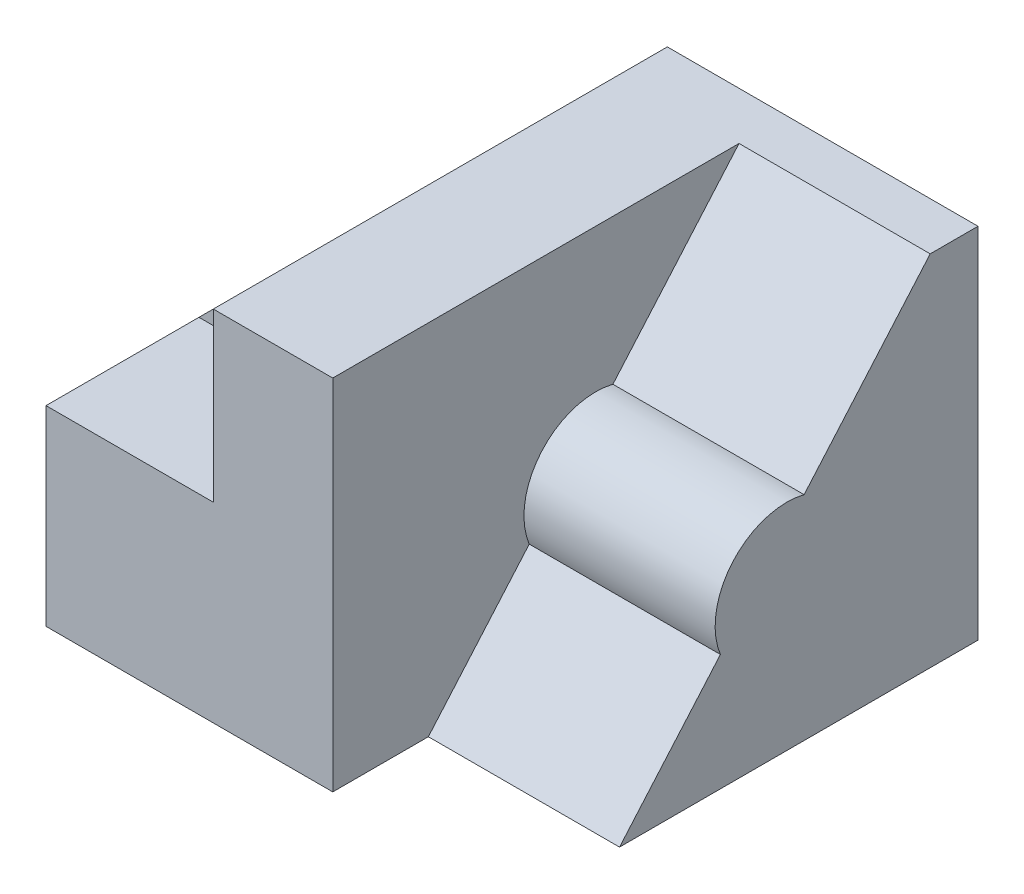
ISO-10303-21;
HEADER;
FILE_DESCRIPTION(('STEP AP214'),'2;1');
FILE_NAME('part.step','',(''),(''),'','','');
FILE_SCHEMA(('AUTOMOTIVE_DESIGN { 1 0 10303 214 1 1 1 1 }'));
ENDSEC;
DATA;
#1=APPLICATION_CONTEXT('core data for automotive mechanical design processes');
#2=APPLICATION_PROTOCOL_DEFINITION('international standard','automotive_design',2000,#1);
#3=PRODUCT_CONTEXT('',#1,'mechanical');
#4=PRODUCT('Part','Part','',(#3));
#5=PRODUCT_RELATED_PRODUCT_CATEGORY('part','',(#4));
#6=PRODUCT_DEFINITION_FORMATION('','',#4);
#7=PRODUCT_DEFINITION_CONTEXT('part definition',#1,'design');
#8=PRODUCT_DEFINITION('design','',#6,#7);
#9=PRODUCT_DEFINITION_SHAPE('','',#8);
#10=(LENGTH_UNIT() NAMED_UNIT(*) SI_UNIT(.MILLI.,.METRE.));
#11=(NAMED_UNIT(*) PLANE_ANGLE_UNIT() SI_UNIT($,.RADIAN.));
#12=(NAMED_UNIT(*) SI_UNIT($,.STERADIAN.) SOLID_ANGLE_UNIT());
#13=UNCERTAINTY_MEASURE_WITH_UNIT(LENGTH_MEASURE(1.E-05),#10,'distance_accuracy_value','');
#14=(GEOMETRIC_REPRESENTATION_CONTEXT(3) GLOBAL_UNCERTAINTY_ASSIGNED_CONTEXT((#13)) GLOBAL_UNIT_ASSIGNED_CONTEXT((#10,
#11,#12)) REPRESENTATION_CONTEXT('',''));
#15=CARTESIAN_POINT('',(0.,0.,0.));
#16=DIRECTION('',(0.,0.,1.));
#17=DIRECTION('',(1.,0.,0.));
#18=AXIS2_PLACEMENT_3D('',#15,#16,#17);
#19=CARTESIAN_POINT('',(35.,37.5,-47.5));
#20=DIRECTION('',(1.,0.,0.));
#21=DIRECTION('',(0.,1.,0.));
#22=AXIS2_PLACEMENT_3D('',#19,#20,#21);
#23=PLANE('',#22);
#24=DIRECTION('',(0.,1.,0.));
#25=VECTOR('',#24,1.);
#26=CARTESIAN_POINT('',(35.,2.49999999999999,15.5));
#27=LINE('',#26,#25);
#28=CARTESIAN_POINT('',(35.,2.49999999999999,15.5));
#29=VERTEX_POINT('',#28);
#30=CARTESIAN_POINT('',(35.,37.5,15.5));
#31=VERTEX_POINT('',#30);
#32=EDGE_CURVE('E148',#29,#31,#27,.T.);
#33=ORIENTED_EDGE('',*,*,#32,.F.);
#34=DIRECTION('',(0.,0.,1.));
#35=VECTOR('',#34,1.);
#36=CARTESIAN_POINT('',(35.,2.49999999999999,-47.5));
#37=LINE('',#36,#35);
#38=CARTESIAN_POINT('',(35.,2.49999999999999,47.5));
#39=VERTEX_POINT('',#38);
#40=EDGE_CURVE('E196',#29,#39,#37,.T.);
#41=ORIENTED_EDGE('',*,*,#40,.T.);
#42=DIRECTION('',(0.,1.,0.));
#43=VECTOR('',#42,1.);
#44=CARTESIAN_POINT('',(35.,37.5,47.5));
#45=LINE('',#44,#43);
#46=CARTESIAN_POINT('',(35.,37.5,47.5));
#47=VERTEX_POINT('',#46);
#48=EDGE_CURVE('E161',#39,#47,#45,.T.);
#49=ORIENTED_EDGE('',*,*,#48,.T.);
#50=DIRECTION('',(0.,0.,1.));
#51=VECTOR('',#50,1.);
#52=CARTESIAN_POINT('',(35.,37.5,-47.5));
#53=LINE('',#52,#51);
#54=EDGE_CURVE('E159',#31,#47,#53,.T.);
#55=ORIENTED_EDGE('',*,*,#54,.F.);
#56=EDGE_LOOP('',(#33,#41,#49,#55));
#57=FACE_BOUND('',#56,.T.);
#58=ADVANCED_FACE('F39',(#57),#23,.F.);
#59=CARTESIAN_POINT('',(0.,2.49999999999999,-47.5));
#60=DIRECTION('',(0.,-1.,0.));
#61=DIRECTION('',(0.,0.,-1.));
#62=AXIS2_PLACEMENT_3D('',#59,#60,#61);
#63=PLANE('',#62);
#64=DIRECTION('',(1.,0.,0.));
#65=VECTOR('',#64,1.);
#66=CARTESIAN_POINT('',(0.,2.49999999999999,15.5));
#67=LINE('',#66,#65);
#68=CARTESIAN_POINT('',(0.,2.49999999999999,15.5));
#69=VERTEX_POINT('',#68);
#70=EDGE_CURVE('E147',#69,#29,#67,.T.);
#71=ORIENTED_EDGE('',*,*,#70,.F.);
#72=DIRECTION('',(0.,0.,1.));
#73=VECTOR('',#72,1.);
#74=CARTESIAN_POINT('',(0.,2.49999999999999,-47.5));
#75=LINE('',#74,#73);
#76=CARTESIAN_POINT('',(0.,2.49999999999999,47.5));
#77=VERTEX_POINT('',#76);
#78=EDGE_CURVE('E187',#69,#77,#75,.T.);
#79=ORIENTED_EDGE('',*,*,#78,.T.);
#80=DIRECTION('',(1.,0.,0.));
#81=VECTOR('',#80,1.);
#82=CARTESIAN_POINT('',(0.,2.49999999999999,47.5));
#83=LINE('',#82,#81);
#84=EDGE_CURVE('E173',#77,#39,#83,.T.);
#85=ORIENTED_EDGE('',*,*,#84,.T.);
#86=ORIENTED_EDGE('',*,*,#40,.F.);
#87=EDGE_LOOP('',(#71,#79,#85,#86));
#88=FACE_BOUND('',#87,.T.);
#89=ADVANCED_FACE('F312',(#88),#63,.F.);
#90=CARTESIAN_POINT('',(100.,37.5,47.5));
#91=DIRECTION('',(0.,0.,-1.));
#92=DIRECTION('',(0.,1.,0.));
#93=AXIS2_PLACEMENT_3D('',#90,#91,#92);
#94=PLANE('',#93);
#95=DIRECTION('',(-1.,0.,0.));
#96=VECTOR('',#95,1.);
#97=CARTESIAN_POINT('',(100.,37.5,47.5));
#98=LINE('',#97,#96);
#99=CARTESIAN_POINT('',(60.,37.5,47.5));
#100=VERTEX_POINT('',#99);
#101=EDGE_CURVE('E255',#100,#47,#98,.T.);
#102=ORIENTED_EDGE('',*,*,#101,.T.);
#103=ORIENTED_EDGE('',*,*,#48,.F.);
#104=ORIENTED_EDGE('',*,*,#84,.F.);
#105=DIRECTION('',(0.,-1.,0.));
#106=VECTOR('',#105,1.);
#107=CARTESIAN_POINT('',(0.,37.5,47.5));
#108=LINE('',#107,#106);
#109=CARTESIAN_POINT('',(0.,-37.5,47.5));
#110=VERTEX_POINT('',#109);
#111=EDGE_CURVE('E235',#77,#110,#108,.T.);
#112=ORIENTED_EDGE('',*,*,#111,.T.);
#113=DIRECTION('',(-1.,0.,0.));
#114=VECTOR('',#113,1.);
#115=CARTESIAN_POINT('',(100.,-37.5,47.5));
#116=LINE('',#115,#114);
#117=CARTESIAN_POINT('',(60.,-37.5,47.5));
#118=VERTEX_POINT('',#117);
#119=EDGE_CURVE('E11',#118,#110,#116,.T.);
#120=ORIENTED_EDGE('',*,*,#119,.F.);
#121=DIRECTION('',(0.,-1.,0.));
#122=VECTOR('',#121,1.);
#123=CARTESIAN_POINT('',(60.,37.5,47.5));
#124=LINE('',#123,#122);
#125=EDGE_CURVE('E200',#100,#118,#124,.T.);
#126=ORIENTED_EDGE('',*,*,#125,.F.);
#127=EDGE_LOOP('',(#102,#103,#104,#112,#120,#126));
#128=FACE_BOUND('',#127,.T.);
#129=ADVANCED_FACE('F41',(#128),#94,.F.);
#130=CARTESIAN_POINT('',(100.,-37.5,-47.5));
#131=DIRECTION('',(0.,1.,0.));
#132=DIRECTION('',(0.,0.,1.));
#133=AXIS2_PLACEMENT_3D('',#130,#131,#132);
#134=PLANE('',#133);
#135=DIRECTION('',(1.,0.,0.));
#136=VECTOR('',#135,1.);
#137=CARTESIAN_POINT('',(60.,-37.5,27.5));
#138=LINE('',#137,#136);
#139=CARTESIAN_POINT('',(60.,-37.5,27.5));
#140=VERTEX_POINT('',#139);
#141=CARTESIAN_POINT('',(100.,-37.5,27.5));
#142=VERTEX_POINT('',#141);
#143=EDGE_CURVE('E220',#140,#142,#138,.T.);
#144=ORIENTED_EDGE('',*,*,#143,.F.);
#145=DIRECTION('',(0.,0.,-1.));
#146=VECTOR('',#145,1.);
#147=CARTESIAN_POINT('',(60.,-37.5,47.5));
#148=LINE('',#147,#146);
#149=EDGE_CURVE('E203',#118,#140,#148,.T.);
#150=ORIENTED_EDGE('',*,*,#149,.F.);
#151=ORIENTED_EDGE('',*,*,#119,.T.);
#152=DIRECTION('',(0.,0.,-1.));
#153=VECTOR('',#152,1.);
#154=CARTESIAN_POINT('',(0.,-37.5,-47.5));
#155=LINE('',#154,#153);
#156=CARTESIAN_POINT('',(0.,-37.5,-47.5));
#157=VERTEX_POINT('',#156);
#158=EDGE_CURVE('E258',#110,#157,#155,.T.);
#159=ORIENTED_EDGE('',*,*,#158,.T.);
#160=DIRECTION('',(-1.,0.,0.));
#161=VECTOR('',#160,1.);
#162=CARTESIAN_POINT('',(100.,-37.5,-47.5));
#163=LINE('',#162,#161);
#164=CARTESIAN_POINT('',(100.,-37.5,-47.5));
#165=VERTEX_POINT('',#164);
#166=EDGE_CURVE('E48',#165,#157,#163,.T.);
#167=ORIENTED_EDGE('',*,*,#166,.F.);
#168=DIRECTION('',(0.,0.,-1.));
#169=VECTOR('',#168,1.);
#170=CARTESIAN_POINT('',(100.,-37.5,-47.5));
#171=LINE('',#170,#169);
#172=EDGE_CURVE('E244',#142,#165,#171,.T.);
#173=ORIENTED_EDGE('',*,*,#172,.F.);
#174=EDGE_LOOP('',(#144,#150,#151,#159,#167,#173));
#175=FACE_BOUND('',#174,.T.);
#176=ADVANCED_FACE('F295',(#175),#134,.F.);
#177=CARTESIAN_POINT('',(100.,37.5,-47.5));
#178=DIRECTION('',(0.,-1.,0.));
#179=DIRECTION('',(0.,0.,-1.));
#180=AXIS2_PLACEMENT_3D('',#177,#178,#179);
#181=PLANE('',#180);
#182=DIRECTION('',(-1.,0.,0.));
#183=VECTOR('',#182,1.);
#184=CARTESIAN_POINT('',(100.,37.5,-47.5));
#185=LINE('',#184,#183);
#186=CARTESIAN_POINT('',(100.,37.5,-47.5));
#187=VERTEX_POINT('',#186);
#188=CARTESIAN_POINT('',(35.,37.5,-47.5));
#189=VERTEX_POINT('',#188);
#190=EDGE_CURVE('E266',#187,#189,#185,.T.);
#191=ORIENTED_EDGE('',*,*,#190,.T.);
#192=CARTESIAN_POINT('',(35.,37.5,9.50000000000001));
#193=VERTEX_POINT('',#192);
#194=EDGE_CURVE('E166',#189,#193,#53,.T.);
#195=ORIENTED_EDGE('',*,*,#194,.T.);
#196=DIRECTION('',(0.,0.,-1.));
#197=VECTOR('',#196,1.);
#198=CARTESIAN_POINT('',(35.,37.5,15.5));
#199=LINE('',#198,#197);
#200=EDGE_CURVE('E141',#31,#193,#199,.T.);
#201=ORIENTED_EDGE('',*,*,#200,.F.);
#202=ORIENTED_EDGE('',*,*,#54,.T.);
#203=ORIENTED_EDGE('',*,*,#101,.F.);
#204=DIRECTION('',(0.,0.,1.));
#205=VECTOR('',#204,1.);
#206=CARTESIAN_POINT('',(60.,37.5,-37.5));
#207=LINE('',#206,#205);
#208=CARTESIAN_POINT('',(60.,37.5,-37.5));
#209=VERTEX_POINT('',#208);
#210=EDGE_CURVE('E217',#209,#100,#207,.T.);
#211=ORIENTED_EDGE('',*,*,#210,.F.);
#212=DIRECTION('',(1.,0.,0.));
#213=VECTOR('',#212,1.);
#214=CARTESIAN_POINT('',(60.,37.5,-37.5));
#215=LINE('',#214,#213);
#216=CARTESIAN_POINT('',(100.,37.5,-37.5));
#217=VERTEX_POINT('',#216);
#218=EDGE_CURVE('E231',#209,#217,#215,.T.);
#219=ORIENTED_EDGE('',*,*,#218,.T.);
#220=DIRECTION('',(0.,0.,1.));
#221=VECTOR('',#220,1.);
#222=CARTESIAN_POINT('',(100.,37.5,-47.5));
#223=LINE('',#222,#221);
#224=EDGE_CURVE('E251',#187,#217,#223,.T.);
#225=ORIENTED_EDGE('',*,*,#224,.F.);
#226=EDGE_LOOP('',(#191,#195,#201,#202,#203,#211,#219,#225));
#227=FACE_BOUND('',#226,.T.);
#228=ADVANCED_FACE('F171',(#227),#181,.F.);
#229=CARTESIAN_POINT('',(100.,0.,0.));
#230=DIRECTION('',(-1.,0.,0.));
#231=DIRECTION('',(0.,0.,1.));
#232=AXIS2_PLACEMENT_3D('',#229,#230,#231);
#233=PLANE('',#232);
#234=DIRECTION('',(0.,-0.755689082789818,0.654930538417842));
#235=VECTOR('',#234,1.);
#236=CARTESIAN_POINT('',(100.,37.5,-37.5));
#237=LINE('',#236,#235);
#238=CARTESIAN_POINT('',(100.,7.05750343379361,-11.1165029759545));
#239=VERTEX_POINT('',#238);
#240=EDGE_CURVE('E204',#217,#239,#237,.T.);
#241=ORIENTED_EDGE('',*,*,#240,.T.);
#242=CARTESIAN_POINT('',(100.,-7.49999999999999,-7.5));
#243=DIRECTION('',(1.,0.,0.));
#244=DIRECTION('',(0.,0.,-1.));
#245=AXIS2_PLACEMENT_3D('',#242,#243,#244);
#246=CIRCLE('',#245,15.);
#247=CARTESIAN_POINT('',(100.,-13.1488739921692,6.39569079321334));
#248=VERTEX_POINT('',#247);
#249=EDGE_CURVE('E224',#239,#248,#246,.T.);
#250=ORIENTED_EDGE('',*,*,#249,.T.);
#251=DIRECTION('',(0.,-0.755689082789818,0.654930538417842));
#252=VECTOR('',#251,1.);
#253=CARTESIAN_POINT('',(100.,-13.1488739921692,6.39569079321334));
#254=LINE('',#253,#252);
#255=EDGE_CURVE('E192',#248,#142,#254,.T.);
#256=ORIENTED_EDGE('',*,*,#255,.T.);
#257=ORIENTED_EDGE('',*,*,#172,.T.);
#258=DIRECTION('',(0.,1.,0.));
#259=VECTOR('',#258,1.);
#260=CARTESIAN_POINT('',(100.,37.5,-47.5));
#261=LINE('',#260,#259);
#262=EDGE_CURVE('E247',#165,#187,#261,.T.);
#263=ORIENTED_EDGE('',*,*,#262,.T.);
#264=ORIENTED_EDGE('',*,*,#224,.T.);
#265=EDGE_LOOP('',(#241,#250,#256,#257,#263,#264));
#266=FACE_BOUND('',#265,.T.);
#267=ADVANCED_FACE('F292',(#266),#233,.F.);
#268=CARTESIAN_POINT('',(100.,37.5,-47.5));
#269=DIRECTION('',(0.,0.,1.));
#270=DIRECTION('',(0.,-1.,0.));
#271=AXIS2_PLACEMENT_3D('',#268,#269,#270);
#272=PLANE('',#271);
#273=DIRECTION('',(1.,0.,0.));
#274=VECTOR('',#273,1.);
#275=CARTESIAN_POINT('',(0.,2.49999999999999,-47.5));
#276=LINE('',#275,#274);
#277=CARTESIAN_POINT('',(0.,2.49999999999999,-47.5));
#278=VERTEX_POINT('',#277);
#279=CARTESIAN_POINT('',(35.,2.49999999999999,-47.5));
#280=VERTEX_POINT('',#279);
#281=EDGE_CURVE('E63',#278,#280,#276,.T.);
#282=ORIENTED_EDGE('',*,*,#281,.T.);
#283=DIRECTION('',(0.,1.,0.));
#284=VECTOR('',#283,1.);
#285=CARTESIAN_POINT('',(35.,37.5,-47.5));
#286=LINE('',#285,#284);
#287=EDGE_CURVE('E184',#280,#189,#286,.T.);
#288=ORIENTED_EDGE('',*,*,#287,.T.);
#289=ORIENTED_EDGE('',*,*,#190,.F.);
#290=ORIENTED_EDGE('',*,*,#262,.F.);
#291=ORIENTED_EDGE('',*,*,#166,.T.);
#292=DIRECTION('',(0.,1.,0.));
#293=VECTOR('',#292,1.);
#294=CARTESIAN_POINT('',(0.,37.5,-47.5));
#295=LINE('',#294,#293);
#296=EDGE_CURVE('E248',#157,#278,#295,.T.);
#297=ORIENTED_EDGE('',*,*,#296,.T.);
#298=EDGE_LOOP('',(#282,#288,#289,#290,#291,#297));
#299=FACE_BOUND('',#298,.T.);
#300=ADVANCED_FACE('F274',(#299),#272,.F.);
#301=CARTESIAN_POINT('',(0.,0.,0.));
#302=DIRECTION('',(-1.,0.,0.));
#303=DIRECTION('',(0.,0.,1.));
#304=AXIS2_PLACEMENT_3D('',#301,#302,#303);
#305=PLANE('',#304);
#306=CARTESIAN_POINT('',(0.,2.49999999999999,9.50000000000001));
#307=VERTEX_POINT('',#306);
#308=EDGE_CURVE('E197',#278,#307,#75,.T.);
#309=ORIENTED_EDGE('',*,*,#308,.F.);
#310=ORIENTED_EDGE('',*,*,#296,.F.);
#311=ORIENTED_EDGE('',*,*,#158,.F.);
#312=ORIENTED_EDGE('',*,*,#111,.F.);
#313=ORIENTED_EDGE('',*,*,#78,.F.);
#314=DIRECTION('',(0.,0.,-1.));
#315=VECTOR('',#314,1.);
#316=CARTESIAN_POINT('',(0.,2.49999999999999,15.5));
#317=LINE('',#316,#315);
#318=EDGE_CURVE('E143',#69,#307,#317,.T.);
#319=ORIENTED_EDGE('',*,*,#318,.T.);
#320=EDGE_LOOP('',(#309,#310,#311,#312,#313,#319));
#321=FACE_BOUND('',#320,.T.);
#322=ADVANCED_FACE('F280',(#321),#305,.T.);
#323=CARTESIAN_POINT('',(60.,37.5,-37.5));
#324=DIRECTION('',(0.,0.654930538417842,0.755689082789818));
#325=DIRECTION('',(0.,-0.755689082789818,0.654930538417842));
#326=AXIS2_PLACEMENT_3D('',#323,#324,#325);
#327=PLANE('',#326);
#328=ORIENTED_EDGE('',*,*,#240,.F.);
#329=ORIENTED_EDGE('',*,*,#218,.F.);
#330=DIRECTION('',(0.,-0.755689082789818,0.654930538417842));
#331=VECTOR('',#330,1.);
#332=CARTESIAN_POINT('',(60.,37.5,-37.5));
#333=LINE('',#332,#331);
#334=CARTESIAN_POINT('',(60.,7.05750343379361,-11.1165029759545));
#335=VERTEX_POINT('',#334);
#336=EDGE_CURVE('E214',#209,#335,#333,.T.);
#337=ORIENTED_EDGE('',*,*,#336,.T.);
#338=DIRECTION('',(1.,0.,0.));
#339=VECTOR('',#338,1.);
#340=CARTESIAN_POINT('',(60.,7.05750343379361,-11.1165029759545));
#341=LINE('',#340,#339);
#342=EDGE_CURVE('E236',#335,#239,#341,.T.);
#343=ORIENTED_EDGE('',*,*,#342,.T.);
#344=EDGE_LOOP('',(#328,#329,#337,#343));
#345=FACE_BOUND('',#344,.T.);
#346=ADVANCED_FACE('F393',(#345),#327,.T.);
#347=CARTESIAN_POINT('',(60.,-7.49999999999999,-7.5));
#348=DIRECTION('',(1.,0.,0.));
#349=DIRECTION('',(0.,0.,-1.));
#350=AXIS2_PLACEMENT_3D('',#347,#348,#349);
#351=CYLINDRICAL_SURFACE('',#350,15.);
#352=ORIENTED_EDGE('',*,*,#249,.F.);
#353=ORIENTED_EDGE('',*,*,#342,.F.);
#354=CARTESIAN_POINT('',(60.,-7.49999999999999,-7.5));
#355=DIRECTION('',(1.,0.,0.));
#356=DIRECTION('',(0.,0.,-1.));
#357=AXIS2_PLACEMENT_3D('',#354,#355,#356);
#358=CIRCLE('',#357,15.);
#359=CARTESIAN_POINT('',(60.,-13.1488739921692,6.39569079321334));
#360=VERTEX_POINT('',#359);
#361=EDGE_CURVE('E211',#335,#360,#358,.T.);
#362=ORIENTED_EDGE('',*,*,#361,.T.);
#363=DIRECTION('',(1.,0.,0.));
#364=VECTOR('',#363,1.);
#365=CARTESIAN_POINT('',(60.,-13.1488739921692,6.39569079321334));
#366=LINE('',#365,#364);
#367=EDGE_CURVE('E239',#360,#248,#366,.T.);
#368=ORIENTED_EDGE('',*,*,#367,.T.);
#369=EDGE_LOOP('',(#352,#353,#362,#368));
#370=FACE_BOUND('',#369,.T.);
#371=ADVANCED_FACE('F385',(#370),#351,.T.);
#372=CARTESIAN_POINT('',(60.,-13.1488739921692,6.39569079321334));
#373=DIRECTION('',(0.,0.654930538417842,0.755689082789818));
#374=DIRECTION('',(0.,-0.755689082789818,0.654930538417842));
#375=AXIS2_PLACEMENT_3D('',#372,#373,#374);
#376=PLANE('',#375);
#377=ORIENTED_EDGE('',*,*,#255,.F.);
#378=ORIENTED_EDGE('',*,*,#367,.F.);
#379=DIRECTION('',(0.,-0.755689082789818,0.654930538417842));
#380=VECTOR('',#379,1.);
#381=CARTESIAN_POINT('',(60.,-13.1488739921692,6.39569079321334));
#382=LINE('',#381,#380);
#383=EDGE_CURVE('E208',#360,#140,#382,.T.);
#384=ORIENTED_EDGE('',*,*,#383,.T.);
#385=ORIENTED_EDGE('',*,*,#143,.T.);
#386=EDGE_LOOP('',(#377,#378,#384,#385));
#387=FACE_BOUND('',#386,.T.);
#388=ADVANCED_FACE('F299',(#387),#376,.T.);
#389=CARTESIAN_POINT('',(60.,-7.49999999999999,-7.5));
#390=DIRECTION('',(1.,0.,0.));
#391=DIRECTION('',(0.,0.,-1.));
#392=AXIS2_PLACEMENT_3D('',#389,#390,#391);
#393=PLANE('',#392);
#394=ORIENTED_EDGE('',*,*,#125,.T.);
#395=ORIENTED_EDGE('',*,*,#149,.T.);
#396=ORIENTED_EDGE('',*,*,#383,.F.);
#397=ORIENTED_EDGE('',*,*,#361,.F.);
#398=ORIENTED_EDGE('',*,*,#336,.F.);
#399=ORIENTED_EDGE('',*,*,#210,.T.);
#400=EDGE_LOOP('',(#394,#395,#396,#397,#398,#399));
#401=FACE_BOUND('',#400,.T.);
#402=ADVANCED_FACE('F304',(#401),#393,.T.);
#403=CARTESIAN_POINT('',(35.,2.49999999999999,9.50000000000001));
#404=VERTEX_POINT('',#403);
#405=EDGE_CURVE('E167',#280,#404,#37,.T.);
#406=ORIENTED_EDGE('',*,*,#405,.T.);
#407=DIRECTION('',(0.,1.,0.));
#408=VECTOR('',#407,1.);
#409=CARTESIAN_POINT('',(35.,2.49999999999999,9.50000000000001));
#410=LINE('',#409,#408);
#411=EDGE_CURVE('E55',#404,#193,#410,.T.);
#412=ORIENTED_EDGE('',*,*,#411,.T.);
#413=ORIENTED_EDGE('',*,*,#194,.F.);
#414=ORIENTED_EDGE('',*,*,#287,.F.);
#415=EDGE_LOOP('',(#406,#412,#413,#414));
#416=FACE_BOUND('',#415,.T.);
#417=ADVANCED_FACE('F288',(#416),#23,.F.);
#418=ORIENTED_EDGE('',*,*,#308,.T.);
#419=DIRECTION('',(1.,0.,0.));
#420=VECTOR('',#419,1.);
#421=CARTESIAN_POINT('',(0.,2.49999999999999,9.50000000000001));
#422=LINE('',#421,#420);
#423=EDGE_CURVE('E156',#307,#404,#422,.T.);
#424=ORIENTED_EDGE('',*,*,#423,.T.);
#425=ORIENTED_EDGE('',*,*,#405,.F.);
#426=ORIENTED_EDGE('',*,*,#281,.F.);
#427=EDGE_LOOP('',(#418,#424,#425,#426));
#428=FACE_BOUND('',#427,.T.);
#429=ADVANCED_FACE('F283',(#428),#63,.F.);
#430=CARTESIAN_POINT('',(35.,37.5,15.5));
#431=DIRECTION('',(0.707106781186548,-0.707106781186547,0.));
#432=DIRECTION('',(0.707106781186547,0.707106781186548,0.));
#433=AXIS2_PLACEMENT_3D('',#430,#431,#432);
#434=PLANE('',#433);
#435=DIRECTION('',(-0.707106781186548,-0.707106781186548,0.));
#436=VECTOR('',#435,1.);
#437=CARTESIAN_POINT('',(35.,37.5,9.50000000000001));
#438=LINE('',#437,#436);
#439=EDGE_CURVE('E286',#193,#307,#438,.T.);
#440=ORIENTED_EDGE('',*,*,#439,.T.);
#441=ORIENTED_EDGE('',*,*,#318,.F.);
#442=DIRECTION('',(-0.707106781186548,-0.707106781186548,0.));
#443=VECTOR('',#442,1.);
#444=CARTESIAN_POINT('',(35.,37.5,15.5));
#445=LINE('',#444,#443);
#446=EDGE_CURVE('E137',#31,#69,#445,.T.);
#447=ORIENTED_EDGE('',*,*,#446,.F.);
#448=ORIENTED_EDGE('',*,*,#200,.T.);
#449=EDGE_LOOP('',(#440,#441,#447,#448));
#450=FACE_BOUND('',#449,.T.);
#451=ADVANCED_FACE('F139',(#450),#434,.F.);
#452=CARTESIAN_POINT('',(0.,0.,15.5));
#453=DIRECTION('',(0.,0.,-1.));
#454=DIRECTION('',(-1.,0.,0.));
#455=AXIS2_PLACEMENT_3D('',#452,#453,#454);
#456=PLANE('',#455);
#457=ORIENTED_EDGE('',*,*,#32,.T.);
#458=ORIENTED_EDGE('',*,*,#446,.T.);
#459=ORIENTED_EDGE('',*,*,#70,.T.);
#460=EDGE_LOOP('',(#457,#458,#459));
#461=FACE_BOUND('',#460,.T.);
#462=ADVANCED_FACE('F152',(#461),#456,.F.);
#463=CARTESIAN_POINT('',(0.,0.,9.50000000000001));
#464=DIRECTION('',(0.,0.,-1.));
#465=DIRECTION('',(-1.,0.,0.));
#466=AXIS2_PLACEMENT_3D('',#463,#464,#465);
#467=PLANE('',#466);
#468=ORIENTED_EDGE('',*,*,#411,.F.);
#469=ORIENTED_EDGE('',*,*,#423,.F.);
#470=ORIENTED_EDGE('',*,*,#439,.F.);
#471=EDGE_LOOP('',(#468,#469,#470));
#472=FACE_BOUND('',#471,.T.);
#473=ADVANCED_FACE('F331',(#472),#467,.T.);
#474=CLOSED_SHELL('',(#58,#89,#129,#176,#228,#267,#300,#322,#346,#371,#388,#402,#417,#429,#451,
#462,#473));
#475=MANIFOLD_SOLID_BREP('B2',#474);
#476=ADVANCED_BREP_SHAPE_REPRESENTATION('',(#18,#475),#14);
#477=SHAPE_DEFINITION_REPRESENTATION(#9,#476);
ENDSEC;
END-ISO-10303-21;
